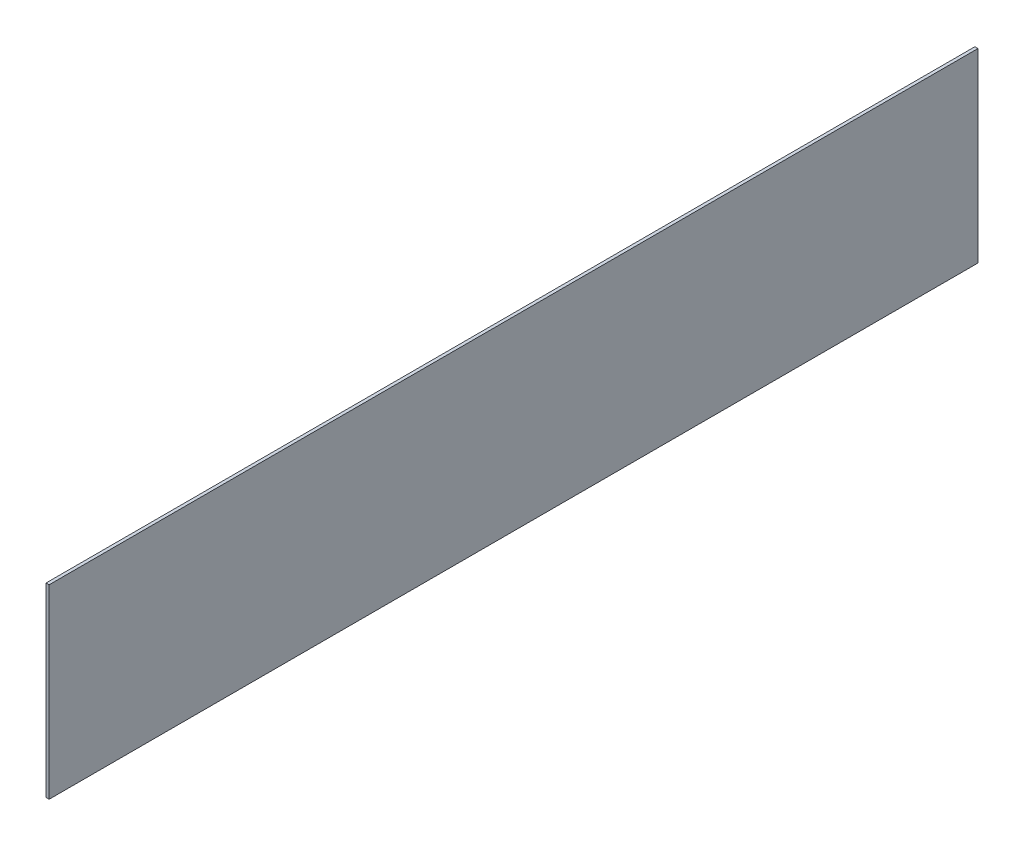
ISO-10303-21;
HEADER;
FILE_DESCRIPTION(('STEP AP214'),'2;1');
FILE_NAME('part.step','',(''),(''),'','','');
FILE_SCHEMA(('AUTOMOTIVE_DESIGN { 1 0 10303 214 1 1 1 1 }'));
ENDSEC;
DATA;
#1=APPLICATION_CONTEXT('core data for automotive mechanical design processes');
#2=APPLICATION_PROTOCOL_DEFINITION('international standard','automotive_design',2000,#1);
#3=PRODUCT_CONTEXT('',#1,'mechanical');
#4=PRODUCT('Part','Part','',(#3));
#5=PRODUCT_RELATED_PRODUCT_CATEGORY('part','',(#4));
#6=PRODUCT_DEFINITION_FORMATION('','',#4);
#7=PRODUCT_DEFINITION_CONTEXT('part definition',#1,'design');
#8=PRODUCT_DEFINITION('design','',#6,#7);
#9=PRODUCT_DEFINITION_SHAPE('','',#8);
#10=(LENGTH_UNIT() NAMED_UNIT(*) SI_UNIT(.MILLI.,.METRE.));
#11=(NAMED_UNIT(*) PLANE_ANGLE_UNIT() SI_UNIT($,.RADIAN.));
#12=(NAMED_UNIT(*) SI_UNIT($,.STERADIAN.) SOLID_ANGLE_UNIT());
#13=UNCERTAINTY_MEASURE_WITH_UNIT(LENGTH_MEASURE(1.E-05),#10,'distance_accuracy_value','');
#14=(GEOMETRIC_REPRESENTATION_CONTEXT(3) GLOBAL_UNCERTAINTY_ASSIGNED_CONTEXT((#13)) GLOBAL_UNIT_ASSIGNED_CONTEXT((#10,
#11,#12)) REPRESENTATION_CONTEXT('',''));
#15=CARTESIAN_POINT('',(0.,0.,0.));
#16=DIRECTION('',(0.,0.,1.));
#17=DIRECTION('',(1.,0.,0.));
#18=AXIS2_PLACEMENT_3D('',#15,#16,#17);
#19=CARTESIAN_POINT('',(1.,0.,300.));
#20=DIRECTION('',(-1.,0.,0.));
#21=DIRECTION('',(0.,0.,1.));
#22=AXIS2_PLACEMENT_3D('',#19,#20,#21);
#23=PLANE('',#22);
#24=DIRECTION('',(0.,1.,0.));
#25=VECTOR('',#24,1.);
#26=CARTESIAN_POINT('',(1.,0.,0.));
#27=LINE('',#26,#25);
#28=CARTESIAN_POINT('',(1.,0.,0.));
#29=VERTEX_POINT('',#28);
#30=CARTESIAN_POINT('',(1.,60.,0.));
#31=VERTEX_POINT('',#30);
#32=EDGE_CURVE('E94',#29,#31,#27,.T.);
#33=ORIENTED_EDGE('',*,*,#32,.T.);
#34=DIRECTION('',(0.,0.,-1.));
#35=VECTOR('',#34,1.);
#36=CARTESIAN_POINT('',(1.,60.,300.));
#37=LINE('',#36,#35);
#38=CARTESIAN_POINT('',(1.,60.,300.));
#39=VERTEX_POINT('',#38);
#40=EDGE_CURVE('E11',#39,#31,#37,.T.);
#41=ORIENTED_EDGE('',*,*,#40,.F.);
#42=DIRECTION('',(0.,1.,0.));
#43=VECTOR('',#42,1.);
#44=CARTESIAN_POINT('',(1.,0.,300.));
#45=LINE('',#44,#43);
#46=CARTESIAN_POINT('',(1.,0.,300.));
#47=VERTEX_POINT('',#46);
#48=EDGE_CURVE('E71',#47,#39,#45,.T.);
#49=ORIENTED_EDGE('',*,*,#48,.F.);
#50=DIRECTION('',(0.,0.,-1.));
#51=VECTOR('',#50,1.);
#52=CARTESIAN_POINT('',(1.,0.,300.));
#53=LINE('',#52,#51);
#54=EDGE_CURVE('E47',#47,#29,#53,.T.);
#55=ORIENTED_EDGE('',*,*,#54,.T.);
#56=EDGE_LOOP('',(#33,#41,#49,#55));
#57=FACE_BOUND('',#56,.T.);
#58=ADVANCED_FACE('F31',(#57),#23,.F.);
#59=CARTESIAN_POINT('',(0.,60.,300.));
#60=DIRECTION('',(0.,1.,0.));
#61=DIRECTION('',(0.,0.,1.));
#62=AXIS2_PLACEMENT_3D('',#59,#60,#61);
#63=PLANE('',#62);
#64=DIRECTION('',(1.,0.,0.));
#65=VECTOR('',#64,1.);
#66=CARTESIAN_POINT('',(0.,60.,0.));
#67=LINE('',#66,#65);
#68=CARTESIAN_POINT('',(0.,60.,0.));
#69=VERTEX_POINT('',#68);
#70=EDGE_CURVE('E80',#69,#31,#67,.T.);
#71=ORIENTED_EDGE('',*,*,#70,.F.);
#72=DIRECTION('',(0.,0.,-1.));
#73=VECTOR('',#72,1.);
#74=CARTESIAN_POINT('',(0.,60.,300.));
#75=LINE('',#74,#73);
#76=CARTESIAN_POINT('',(0.,60.,300.));
#77=VERTEX_POINT('',#76);
#78=EDGE_CURVE('E39',#77,#69,#75,.T.);
#79=ORIENTED_EDGE('',*,*,#78,.F.);
#80=DIRECTION('',(1.,0.,0.));
#81=VECTOR('',#80,1.);
#82=CARTESIAN_POINT('',(0.,60.,300.));
#83=LINE('',#82,#81);
#84=EDGE_CURVE('E78',#77,#39,#83,.T.);
#85=ORIENTED_EDGE('',*,*,#84,.T.);
#86=ORIENTED_EDGE('',*,*,#40,.T.);
#87=EDGE_LOOP('',(#71,#79,#85,#86));
#88=FACE_BOUND('',#87,.T.);
#89=ADVANCED_FACE('F77',(#88),#63,.T.);
#90=CARTESIAN_POINT('',(0.,0.,300.));
#91=DIRECTION('',(-1.,0.,0.));
#92=DIRECTION('',(0.,0.,1.));
#93=AXIS2_PLACEMENT_3D('',#90,#91,#92);
#94=PLANE('',#93);
#95=DIRECTION('',(0.,1.,0.));
#96=VECTOR('',#95,1.);
#97=CARTESIAN_POINT('',(0.,0.,0.));
#98=LINE('',#97,#96);
#99=CARTESIAN_POINT('',(0.,0.,0.));
#100=VERTEX_POINT('',#99);
#101=EDGE_CURVE('E97',#100,#69,#98,.T.);
#102=ORIENTED_EDGE('',*,*,#101,.F.);
#103=DIRECTION('',(0.,0.,-1.));
#104=VECTOR('',#103,1.);
#105=CARTESIAN_POINT('',(0.,0.,300.));
#106=LINE('',#105,#104);
#107=CARTESIAN_POINT('',(0.,0.,300.));
#108=VERTEX_POINT('',#107);
#109=EDGE_CURVE('E60',#108,#100,#106,.T.);
#110=ORIENTED_EDGE('',*,*,#109,.F.);
#111=DIRECTION('',(0.,1.,0.));
#112=VECTOR('',#111,1.);
#113=CARTESIAN_POINT('',(0.,0.,300.));
#114=LINE('',#113,#112);
#115=EDGE_CURVE('E86',#108,#77,#114,.T.);
#116=ORIENTED_EDGE('',*,*,#115,.T.);
#117=ORIENTED_EDGE('',*,*,#78,.T.);
#118=EDGE_LOOP('',(#102,#110,#116,#117));
#119=FACE_BOUND('',#118,.T.);
#120=ADVANCED_FACE('F88',(#119),#94,.T.);
#121=CARTESIAN_POINT('',(1.,0.,300.));
#122=DIRECTION('',(0.,-1.,0.));
#123=DIRECTION('',(0.,0.,-1.));
#124=AXIS2_PLACEMENT_3D('',#121,#122,#123);
#125=PLANE('',#124);
#126=DIRECTION('',(-1.,0.,0.));
#127=VECTOR('',#126,1.);
#128=CARTESIAN_POINT('',(1.,0.,0.));
#129=LINE('',#128,#127);
#130=EDGE_CURVE('E99',#29,#100,#129,.T.);
#131=ORIENTED_EDGE('',*,*,#130,.F.);
#132=ORIENTED_EDGE('',*,*,#54,.F.);
#133=DIRECTION('',(-1.,0.,0.));
#134=VECTOR('',#133,1.);
#135=CARTESIAN_POINT('',(1.,0.,300.));
#136=LINE('',#135,#134);
#137=EDGE_CURVE('E89',#47,#108,#136,.T.);
#138=ORIENTED_EDGE('',*,*,#137,.T.);
#139=ORIENTED_EDGE('',*,*,#109,.T.);
#140=EDGE_LOOP('',(#131,#132,#138,#139));
#141=FACE_BOUND('',#140,.T.);
#142=ADVANCED_FACE('F105',(#141),#125,.T.);
#143=CARTESIAN_POINT('',(1.,60.,300.));
#144=DIRECTION('',(0.,0.,-1.));
#145=DIRECTION('',(-1.,0.,0.));
#146=AXIS2_PLACEMENT_3D('',#143,#144,#145);
#147=PLANE('',#146);
#148=ORIENTED_EDGE('',*,*,#48,.T.);
#149=ORIENTED_EDGE('',*,*,#84,.F.);
#150=ORIENTED_EDGE('',*,*,#115,.F.);
#151=ORIENTED_EDGE('',*,*,#137,.F.);
#152=EDGE_LOOP('',(#148,#149,#150,#151));
#153=FACE_BOUND('',#152,.T.);
#154=ADVANCED_FACE('F85',(#153),#147,.F.);
#155=CARTESIAN_POINT('',(1.,60.,0.));
#156=DIRECTION('',(0.,0.,-1.));
#157=DIRECTION('',(-1.,0.,0.));
#158=AXIS2_PLACEMENT_3D('',#155,#156,#157);
#159=PLANE('',#158);
#160=ORIENTED_EDGE('',*,*,#32,.F.);
#161=ORIENTED_EDGE('',*,*,#130,.T.);
#162=ORIENTED_EDGE('',*,*,#101,.T.);
#163=ORIENTED_EDGE('',*,*,#70,.T.);
#164=EDGE_LOOP('',(#160,#161,#162,#163));
#165=FACE_BOUND('',#164,.T.);
#166=ADVANCED_FACE('F104',(#165),#159,.T.);
#167=CLOSED_SHELL('',(#58,#89,#120,#142,#154,#166));
#168=MANIFOLD_SOLID_BREP('B2',#167);
#169=ADVANCED_BREP_SHAPE_REPRESENTATION('',(#18,#168),#14);
#170=SHAPE_DEFINITION_REPRESENTATION(#9,#169);
ENDSEC;
END-ISO-10303-21;
